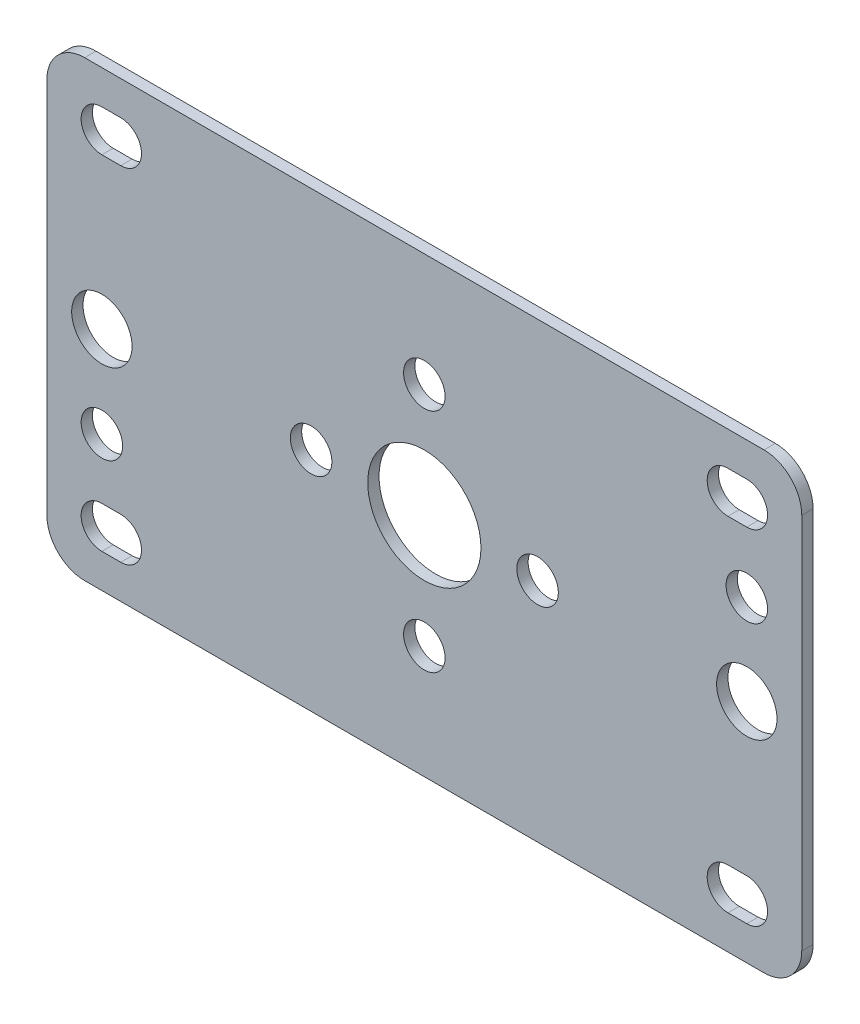
ISO-10303-21;
HEADER;
FILE_DESCRIPTION(('STEP AP214'),'2;1');
FILE_NAME('part.step','',(''),(''),'','','');
FILE_SCHEMA(('AUTOMOTIVE_DESIGN { 1 0 10303 214 1 1 1 1 }'));
ENDSEC;
DATA;
#1=APPLICATION_CONTEXT('core data for automotive mechanical design processes');
#2=APPLICATION_PROTOCOL_DEFINITION('international standard','automotive_design',2000,#1);
#3=PRODUCT_CONTEXT('',#1,'mechanical');
#4=PRODUCT('Part','Part','',(#3));
#5=PRODUCT_RELATED_PRODUCT_CATEGORY('part','',(#4));
#6=PRODUCT_DEFINITION_FORMATION('','',#4);
#7=PRODUCT_DEFINITION_CONTEXT('part definition',#1,'design');
#8=PRODUCT_DEFINITION('design','',#6,#7);
#9=PRODUCT_DEFINITION_SHAPE('','',#8);
#10=(LENGTH_UNIT() NAMED_UNIT(*) SI_UNIT(.MILLI.,.METRE.));
#11=(NAMED_UNIT(*) PLANE_ANGLE_UNIT() SI_UNIT($,.RADIAN.));
#12=(NAMED_UNIT(*) SI_UNIT($,.STERADIAN.) SOLID_ANGLE_UNIT());
#13=UNCERTAINTY_MEASURE_WITH_UNIT(LENGTH_MEASURE(1.E-05),#10,'distance_accuracy_value','');
#14=(GEOMETRIC_REPRESENTATION_CONTEXT(3) GLOBAL_UNCERTAINTY_ASSIGNED_CONTEXT((#13)) GLOBAL_UNIT_ASSIGNED_CONTEXT((#10,
#11,#12)) REPRESENTATION_CONTEXT('',''));
#15=CARTESIAN_POINT('',(0.,0.,0.));
#16=DIRECTION('',(0.,0.,1.));
#17=DIRECTION('',(1.,0.,0.));
#18=AXIS2_PLACEMENT_3D('',#15,#16,#17);
#19=CARTESIAN_POINT('',(0.,0.,0.));
#20=DIRECTION('',(0.,0.,1.));
#21=DIRECTION('',(1.,0.,0.));
#22=AXIS2_PLACEMENT_3D('',#19,#20,#21);
#23=PLANE('',#22);
#24=CARTESIAN_POINT('',(42.72,-22.75,0.));
#25=DIRECTION('',(0.,0.,1.));
#26=DIRECTION('',(1.,0.,0.));
#27=AXIS2_PLACEMENT_3D('',#24,#25,#26);
#28=CIRCLE('',#27,2.75);
#29=CARTESIAN_POINT('',(42.72,-20.,0.));
#30=VERTEX_POINT('',#29);
#31=CARTESIAN_POINT('',(42.72,-25.5,0.));
#32=VERTEX_POINT('',#31);
#33=EDGE_CURVE('E200',#30,#32,#28,.F.);
#34=ORIENTED_EDGE('',*,*,#33,.T.);
#35=DIRECTION('',(1.,0.,0.));
#36=VECTOR('',#35,1.);
#37=CARTESIAN_POINT('',(42.72,-25.5,0.));
#38=LINE('',#37,#36);
#39=CARTESIAN_POINT('',(40.22,-25.5,0.));
#40=VERTEX_POINT('',#39);
#41=EDGE_CURVE('E202',#40,#32,#38,.T.);
#42=ORIENTED_EDGE('',*,*,#41,.F.);
#43=CARTESIAN_POINT('',(40.22,-22.75,0.));
#44=DIRECTION('',(0.,0.,1.));
#45=DIRECTION('',(1.,0.,0.));
#46=AXIS2_PLACEMENT_3D('',#43,#44,#45);
#47=CIRCLE('',#46,2.75);
#48=CARTESIAN_POINT('',(40.22,-20.,0.));
#49=VERTEX_POINT('',#48);
#50=EDGE_CURVE('E204',#40,#49,#47,.F.);
#51=ORIENTED_EDGE('',*,*,#50,.T.);
#52=DIRECTION('',(1.,0.,0.));
#53=VECTOR('',#52,1.);
#54=CARTESIAN_POINT('',(40.22,-20.,0.));
#55=LINE('',#54,#53);
#56=EDGE_CURVE('E197',#30,#49,#55,.F.);
#57=ORIENTED_EDGE('',*,*,#56,.F.);
#58=EDGE_LOOP('',(#34,#42,#51,#57));
#59=FACE_BOUND('',#58,.T.);
#60=DIRECTION('',(1.,0.,0.));
#61=VECTOR('',#60,1.);
#62=CARTESIAN_POINT('',(-40.22,-25.5,0.));
#63=LINE('',#62,#61);
#64=CARTESIAN_POINT('',(-42.72,-25.5,0.));
#65=VERTEX_POINT('',#64);
#66=CARTESIAN_POINT('',(-40.22,-25.5,0.));
#67=VERTEX_POINT('',#66);
#68=EDGE_CURVE('E205',#65,#67,#63,.T.);
#69=ORIENTED_EDGE('',*,*,#68,.F.);
#70=CARTESIAN_POINT('',(-42.72,-22.75,0.));
#71=DIRECTION('',(0.,0.,1.));
#72=DIRECTION('',(1.,0.,0.));
#73=AXIS2_PLACEMENT_3D('',#70,#71,#72);
#74=CIRCLE('',#73,2.75);
#75=CARTESIAN_POINT('',(-42.72,-20.,0.));
#76=VERTEX_POINT('',#75);
#77=EDGE_CURVE('E320',#65,#76,#74,.F.);
#78=ORIENTED_EDGE('',*,*,#77,.T.);
#79=DIRECTION('',(1.,0.,0.));
#80=VECTOR('',#79,1.);
#81=CARTESIAN_POINT('',(-42.72,-20.,0.));
#82=LINE('',#81,#80);
#83=CARTESIAN_POINT('',(-40.22,-20.,0.));
#84=VERTEX_POINT('',#83);
#85=EDGE_CURVE('E209',#84,#76,#82,.F.);
#86=ORIENTED_EDGE('',*,*,#85,.F.);
#87=CARTESIAN_POINT('',(-40.22,-22.75,0.));
#88=DIRECTION('',(0.,0.,1.));
#89=DIRECTION('',(1.,0.,0.));
#90=AXIS2_PLACEMENT_3D('',#87,#88,#89);
#91=CIRCLE('',#90,2.75);
#92=EDGE_CURVE('E212',#84,#67,#91,.F.);
#93=ORIENTED_EDGE('',*,*,#92,.T.);
#94=EDGE_LOOP('',(#69,#78,#86,#93));
#95=FACE_BOUND('',#94,.T.);
#96=CARTESIAN_POINT('',(-42.72,22.75,0.));
#97=DIRECTION('',(0.,0.,1.));
#98=DIRECTION('',(1.,0.,0.));
#99=AXIS2_PLACEMENT_3D('',#96,#97,#98);
#100=CIRCLE('',#99,2.75);
#101=CARTESIAN_POINT('',(-42.72,20.,0.));
#102=VERTEX_POINT('',#101);
#103=CARTESIAN_POINT('',(-42.72,25.5,0.));
#104=VERTEX_POINT('',#103);
#105=EDGE_CURVE('E217',#102,#104,#100,.F.);
#106=ORIENTED_EDGE('',*,*,#105,.T.);
#107=DIRECTION('',(1.,0.,0.));
#108=VECTOR('',#107,1.);
#109=CARTESIAN_POINT('',(-42.72,25.5,0.));
#110=LINE('',#109,#108);
#111=CARTESIAN_POINT('',(-40.22,25.5,0.));
#112=VERTEX_POINT('',#111);
#113=EDGE_CURVE('E219',#112,#104,#110,.F.);
#114=ORIENTED_EDGE('',*,*,#113,.F.);
#115=CARTESIAN_POINT('',(-40.22,22.75,0.));
#116=DIRECTION('',(0.,0.,1.));
#117=DIRECTION('',(1.,0.,0.));
#118=AXIS2_PLACEMENT_3D('',#115,#116,#117);
#119=CIRCLE('',#118,2.75);
#120=CARTESIAN_POINT('',(-40.22,20.,0.));
#121=VERTEX_POINT('',#120);
#122=EDGE_CURVE('E221',#112,#121,#119,.F.);
#123=ORIENTED_EDGE('',*,*,#122,.T.);
#124=DIRECTION('',(1.,0.,0.));
#125=VECTOR('',#124,1.);
#126=CARTESIAN_POINT('',(-40.22,20.,0.));
#127=LINE('',#126,#125);
#128=EDGE_CURVE('E214',#102,#121,#127,.T.);
#129=ORIENTED_EDGE('',*,*,#128,.F.);
#130=EDGE_LOOP('',(#106,#114,#123,#129));
#131=FACE_BOUND('',#130,.T.);
#132=DIRECTION('',(1.,0.,0.));
#133=VECTOR('',#132,1.);
#134=CARTESIAN_POINT('',(40.22,25.5,0.));
#135=LINE('',#134,#133);
#136=CARTESIAN_POINT('',(42.72,25.5,0.));
#137=VERTEX_POINT('',#136);
#138=CARTESIAN_POINT('',(40.22,25.5,0.));
#139=VERTEX_POINT('',#138);
#140=EDGE_CURVE('E222',#137,#139,#135,.F.);
#141=ORIENTED_EDGE('',*,*,#140,.F.);
#142=CARTESIAN_POINT('',(42.72,22.75,0.));
#143=DIRECTION('',(0.,0.,1.));
#144=DIRECTION('',(1.,0.,0.));
#145=AXIS2_PLACEMENT_3D('',#142,#143,#144);
#146=CIRCLE('',#145,2.75);
#147=CARTESIAN_POINT('',(42.72,20.,0.));
#148=VERTEX_POINT('',#147);
#149=EDGE_CURVE('E330',#137,#148,#146,.F.);
#150=ORIENTED_EDGE('',*,*,#149,.T.);
#151=DIRECTION('',(1.,0.,0.));
#152=VECTOR('',#151,1.);
#153=CARTESIAN_POINT('',(42.72,20.,0.));
#154=LINE('',#153,#152);
#155=CARTESIAN_POINT('',(40.22,20.,0.));
#156=VERTEX_POINT('',#155);
#157=EDGE_CURVE('E226',#156,#148,#154,.T.);
#158=ORIENTED_EDGE('',*,*,#157,.F.);
#159=CARTESIAN_POINT('',(40.22,22.75,0.));
#160=DIRECTION('',(0.,0.,1.));
#161=DIRECTION('',(1.,0.,0.));
#162=AXIS2_PLACEMENT_3D('',#159,#160,#161);
#163=CIRCLE('',#162,2.75);
#164=EDGE_CURVE('E228',#156,#139,#163,.F.);
#165=ORIENTED_EDGE('',*,*,#164,.T.);
#166=EDGE_LOOP('',(#141,#150,#158,#165));
#167=FACE_BOUND('',#166,.T.);
#168=CARTESIAN_POINT('',(42.72,0.,0.));
#169=DIRECTION('',(0.,0.,1.));
#170=DIRECTION('',(1.,0.,0.));
#171=AXIS2_PLACEMENT_3D('',#168,#169,#170);
#172=CIRCLE('',#171,4.);
#173=CARTESIAN_POINT('',(46.72,0.,0.));
#174=VERTEX_POINT('',#173);
#175=EDGE_CURVE('E332',#174,#174,#172,.F.);
#176=ORIENTED_EDGE('',*,*,#175,.T.);
#177=EDGE_LOOP('',(#176));
#178=FACE_BOUND('',#177,.T.);
#179=CARTESIAN_POINT('',(0.,0.,0.));
#180=DIRECTION('',(0.,0.,1.));
#181=DIRECTION('',(1.,0.,0.));
#182=AXIS2_PLACEMENT_3D('',#179,#180,#181);
#183=CIRCLE('',#182,7.5);
#184=CARTESIAN_POINT('',(7.5,0.,0.));
#185=VERTEX_POINT('',#184);
#186=EDGE_CURVE('E335',#185,#185,#183,.F.);
#187=ORIENTED_EDGE('',*,*,#186,.T.);
#188=EDGE_LOOP('',(#187));
#189=FACE_BOUND('',#188,.T.);
#190=CARTESIAN_POINT('',(0.,-15.,0.));
#191=DIRECTION('',(0.,0.,1.));
#192=DIRECTION('',(1.,0.,0.));
#193=AXIS2_PLACEMENT_3D('',#190,#191,#192);
#194=CIRCLE('',#193,2.75);
#195=CARTESIAN_POINT('',(2.75,-15.,0.));
#196=VERTEX_POINT('',#195);
#197=EDGE_CURVE('E338',#196,#196,#194,.F.);
#198=ORIENTED_EDGE('',*,*,#197,.T.);
#199=EDGE_LOOP('',(#198));
#200=FACE_BOUND('',#199,.T.);
#201=CARTESIAN_POINT('',(-15.,0.,0.));
#202=DIRECTION('',(0.,0.,1.));
#203=DIRECTION('',(1.,0.,0.));
#204=AXIS2_PLACEMENT_3D('',#201,#202,#203);
#205=CIRCLE('',#204,2.75);
#206=CARTESIAN_POINT('',(-12.25,0.,0.));
#207=VERTEX_POINT('',#206);
#208=EDGE_CURVE('E341',#207,#207,#205,.F.);
#209=ORIENTED_EDGE('',*,*,#208,.T.);
#210=EDGE_LOOP('',(#209));
#211=FACE_BOUND('',#210,.T.);
#212=CARTESIAN_POINT('',(0.,15.,0.));
#213=DIRECTION('',(0.,0.,1.));
#214=DIRECTION('',(1.,0.,0.));
#215=AXIS2_PLACEMENT_3D('',#212,#213,#214);
#216=CIRCLE('',#215,2.75);
#217=CARTESIAN_POINT('',(2.75000000000001,15.,0.));
#218=VERTEX_POINT('',#217);
#219=EDGE_CURVE('E344',#218,#218,#216,.F.);
#220=ORIENTED_EDGE('',*,*,#219,.T.);
#221=EDGE_LOOP('',(#220));
#222=FACE_BOUND('',#221,.T.);
#223=CARTESIAN_POINT('',(15.,0.,0.));
#224=DIRECTION('',(0.,0.,1.));
#225=DIRECTION('',(1.,0.,0.));
#226=AXIS2_PLACEMENT_3D('',#223,#224,#225);
#227=CIRCLE('',#226,2.75);
#228=CARTESIAN_POINT('',(17.75,0.,0.));
#229=VERTEX_POINT('',#228);
#230=EDGE_CURVE('E347',#229,#229,#227,.F.);
#231=ORIENTED_EDGE('',*,*,#230,.T.);
#232=EDGE_LOOP('',(#231));
#233=FACE_BOUND('',#232,.T.);
#234=CARTESIAN_POINT('',(-42.72,-12.05,0.));
#235=DIRECTION('',(0.,0.,1.));
#236=DIRECTION('',(1.,0.,0.));
#237=AXIS2_PLACEMENT_3D('',#234,#235,#236);
#238=CIRCLE('',#237,2.75);
#239=CARTESIAN_POINT('',(-39.97,-12.05,0.));
#240=VERTEX_POINT('',#239);
#241=EDGE_CURVE('E350',#240,#240,#238,.F.);
#242=ORIENTED_EDGE('',*,*,#241,.T.);
#243=EDGE_LOOP('',(#242));
#244=FACE_BOUND('',#243,.T.);
#245=CARTESIAN_POINT('',(42.72,11.97,0.));
#246=DIRECTION('',(0.,0.,1.));
#247=DIRECTION('',(1.,0.,0.));
#248=AXIS2_PLACEMENT_3D('',#245,#246,#247);
#249=CIRCLE('',#248,2.75);
#250=CARTESIAN_POINT('',(45.47,11.97,0.));
#251=VERTEX_POINT('',#250);
#252=EDGE_CURVE('E353',#251,#251,#249,.F.);
#253=ORIENTED_EDGE('',*,*,#252,.T.);
#254=EDGE_LOOP('',(#253));
#255=FACE_BOUND('',#254,.T.);
#256=CARTESIAN_POINT('',(-42.72,0.,0.));
#257=DIRECTION('',(0.,0.,1.));
#258=DIRECTION('',(1.,0.,0.));
#259=AXIS2_PLACEMENT_3D('',#256,#257,#258);
#260=CIRCLE('',#259,4.);
#261=CARTESIAN_POINT('',(-38.72,0.,0.));
#262=VERTEX_POINT('',#261);
#263=EDGE_CURVE('E356',#262,#262,#260,.F.);
#264=ORIENTED_EDGE('',*,*,#263,.T.);
#265=EDGE_LOOP('',(#264));
#266=FACE_BOUND('',#265,.T.);
#267=CARTESIAN_POINT('',(45.,25.,0.));
#268=DIRECTION('',(0.,0.,1.));
#269=DIRECTION('',(1.,0.,0.));
#270=AXIS2_PLACEMENT_3D('',#267,#268,#269);
#271=CIRCLE('',#270,5.);
#272=CARTESIAN_POINT('',(45.,30.,0.));
#273=VERTEX_POINT('',#272);
#274=CARTESIAN_POINT('',(50.,25.,0.));
#275=VERTEX_POINT('',#274);
#276=EDGE_CURVE('E177',#273,#275,#271,.F.);
#277=ORIENTED_EDGE('',*,*,#276,.F.);
#278=DIRECTION('',(1.,0.,0.));
#279=VECTOR('',#278,1.);
#280=CARTESIAN_POINT('',(45.,30.,0.));
#281=LINE('',#280,#279);
#282=CARTESIAN_POINT('',(-45.,30.,0.));
#283=VERTEX_POINT('',#282);
#284=EDGE_CURVE('E175',#283,#273,#281,.T.);
#285=ORIENTED_EDGE('',*,*,#284,.F.);
#286=CARTESIAN_POINT('',(-45.,25.,0.));
#287=DIRECTION('',(0.,0.,1.));
#288=DIRECTION('',(1.,0.,0.));
#289=AXIS2_PLACEMENT_3D('',#286,#287,#288);
#290=CIRCLE('',#289,5.);
#291=CARTESIAN_POINT('',(-50.,25.,0.));
#292=VERTEX_POINT('',#291);
#293=EDGE_CURVE('E19',#292,#283,#290,.F.);
#294=ORIENTED_EDGE('',*,*,#293,.F.);
#295=DIRECTION('',(0.,1.,0.));
#296=VECTOR('',#295,1.);
#297=CARTESIAN_POINT('',(-50.,25.,0.));
#298=LINE('',#297,#296);
#299=CARTESIAN_POINT('',(-50.,-25.,0.));
#300=VERTEX_POINT('',#299);
#301=EDGE_CURVE('E241',#300,#292,#298,.T.);
#302=ORIENTED_EDGE('',*,*,#301,.F.);
#303=CARTESIAN_POINT('',(-45.,-25.,0.));
#304=DIRECTION('',(0.,0.,1.));
#305=DIRECTION('',(1.,0.,0.));
#306=AXIS2_PLACEMENT_3D('',#303,#304,#305);
#307=CIRCLE('',#306,5.);
#308=CARTESIAN_POINT('',(-45.,-30.,0.));
#309=VERTEX_POINT('',#308);
#310=EDGE_CURVE('E363',#309,#300,#307,.F.);
#311=ORIENTED_EDGE('',*,*,#310,.F.);
#312=DIRECTION('',(1.,0.,0.));
#313=VECTOR('',#312,1.);
#314=CARTESIAN_POINT('',(-45.,-30.,0.));
#315=LINE('',#314,#313);
#316=CARTESIAN_POINT('',(45.,-30.,0.));
#317=VERTEX_POINT('',#316);
#318=EDGE_CURVE('E236',#317,#309,#315,.F.);
#319=ORIENTED_EDGE('',*,*,#318,.F.);
#320=CARTESIAN_POINT('',(45.,-25.,0.));
#321=DIRECTION('',(0.,0.,1.));
#322=DIRECTION('',(1.,0.,0.));
#323=AXIS2_PLACEMENT_3D('',#320,#321,#322);
#324=CIRCLE('',#323,5.);
#325=CARTESIAN_POINT('',(50.,-25.,0.));
#326=VERTEX_POINT('',#325);
#327=EDGE_CURVE('E361',#326,#317,#324,.F.);
#328=ORIENTED_EDGE('',*,*,#327,.F.);
#329=DIRECTION('',(0.,1.,0.));
#330=VECTOR('',#329,1.);
#331=CARTESIAN_POINT('',(50.,-25.,0.));
#332=LINE('',#331,#330);
#333=EDGE_CURVE('E231',#275,#326,#332,.F.);
#334=ORIENTED_EDGE('',*,*,#333,.F.);
#335=EDGE_LOOP('',(#277,#285,#294,#302,#311,#319,#328,#334));
#336=FACE_BOUND('',#335,.T.);
#337=ADVANCED_FACE('F16',(#59,#95,#131,#167,#178,#189,#200,#211,#222,#233,#244,#255,#266,#336),
#23,.T.);
#338=CARTESIAN_POINT('',(45.,30.,0.));
#339=DIRECTION('',(0.,1.,0.));
#340=DIRECTION('',(0.,0.,1.));
#341=AXIS2_PLACEMENT_3D('',#338,#339,#340);
#342=PLANE('',#341);
#343=DIRECTION('',(0.,0.,1.));
#344=VECTOR('',#343,1.);
#345=CARTESIAN_POINT('',(-45.,30.,0.));
#346=LINE('',#345,#344);
#347=CARTESIAN_POINT('',(-45.,30.,-1.5));
#348=VERTEX_POINT('',#347);
#349=EDGE_CURVE('E182',#283,#348,#346,.F.);
#350=ORIENTED_EDGE('',*,*,#349,.F.);
#351=ORIENTED_EDGE('',*,*,#284,.T.);
#352=DIRECTION('',(0.,0.,1.));
#353=VECTOR('',#352,1.);
#354=CARTESIAN_POINT('',(45.,30.,0.));
#355=LINE('',#354,#353);
#356=CARTESIAN_POINT('',(45.,30.,-1.5));
#357=VERTEX_POINT('',#356);
#358=EDGE_CURVE('E360',#357,#273,#355,.T.);
#359=ORIENTED_EDGE('',*,*,#358,.F.);
#360=DIRECTION('',(1.,0.,0.));
#361=VECTOR('',#360,1.);
#362=CARTESIAN_POINT('',(0.,30.,-1.5));
#363=LINE('',#362,#361);
#364=EDGE_CURVE('E192',#357,#348,#363,.F.);
#365=ORIENTED_EDGE('',*,*,#364,.T.);
#366=EDGE_LOOP('',(#350,#351,#359,#365));
#367=FACE_BOUND('',#366,.T.);
#368=ADVANCED_FACE('F191',(#367),#342,.T.);
#369=CARTESIAN_POINT('',(-45.,25.,0.));
#370=DIRECTION('',(0.,0.,1.));
#371=DIRECTION('',(1.,0.,0.));
#372=AXIS2_PLACEMENT_3D('',#369,#370,#371);
#373=CYLINDRICAL_SURFACE('',#372,5.);
#374=DIRECTION('',(0.,0.,1.));
#375=VECTOR('',#374,1.);
#376=CARTESIAN_POINT('',(-50.,25.,0.));
#377=LINE('',#376,#375);
#378=CARTESIAN_POINT('',(-50.,25.,-1.5));
#379=VERTEX_POINT('',#378);
#380=EDGE_CURVE('E189',#292,#379,#377,.F.);
#381=ORIENTED_EDGE('',*,*,#380,.F.);
#382=ORIENTED_EDGE('',*,*,#293,.T.);
#383=ORIENTED_EDGE('',*,*,#349,.T.);
#384=CARTESIAN_POINT('',(-45.,25.,-1.5));
#385=DIRECTION('',(0.,0.,1.));
#386=DIRECTION('',(1.,0.,0.));
#387=AXIS2_PLACEMENT_3D('',#384,#385,#386);
#388=CIRCLE('',#387,5.);
#389=EDGE_CURVE('E311',#348,#379,#388,.T.);
#390=ORIENTED_EDGE('',*,*,#389,.T.);
#391=EDGE_LOOP('',(#381,#382,#383,#390));
#392=FACE_BOUND('',#391,.T.);
#393=ADVANCED_FACE('F186',(#392),#373,.T.);
#394=CARTESIAN_POINT('',(-50.,25.,0.));
#395=DIRECTION('',(-1.,0.,0.));
#396=DIRECTION('',(0.,0.,1.));
#397=AXIS2_PLACEMENT_3D('',#394,#395,#396);
#398=PLANE('',#397);
#399=DIRECTION('',(0.,0.,1.));
#400=VECTOR('',#399,1.);
#401=CARTESIAN_POINT('',(-50.,-25.,0.));
#402=LINE('',#401,#400);
#403=CARTESIAN_POINT('',(-50.,-25.,-1.5));
#404=VERTEX_POINT('',#403);
#405=EDGE_CURVE('E242',#300,#404,#402,.F.);
#406=ORIENTED_EDGE('',*,*,#405,.F.);
#407=ORIENTED_EDGE('',*,*,#301,.T.);
#408=ORIENTED_EDGE('',*,*,#380,.T.);
#409=DIRECTION('',(0.,1.,0.));
#410=VECTOR('',#409,1.);
#411=CARTESIAN_POINT('',(-50.,0.,-1.5));
#412=LINE('',#411,#410);
#413=EDGE_CURVE('E310',#379,#404,#412,.F.);
#414=ORIENTED_EDGE('',*,*,#413,.T.);
#415=EDGE_LOOP('',(#406,#407,#408,#414));
#416=FACE_BOUND('',#415,.T.);
#417=ADVANCED_FACE('F556',(#416),#398,.T.);
#418=CARTESIAN_POINT('',(-45.,-25.,0.));
#419=DIRECTION('',(0.,0.,1.));
#420=DIRECTION('',(1.,0.,0.));
#421=AXIS2_PLACEMENT_3D('',#418,#419,#420);
#422=CYLINDRICAL_SURFACE('',#421,5.);
#423=DIRECTION('',(0.,0.,-1.));
#424=VECTOR('',#423,1.);
#425=CARTESIAN_POINT('',(-45.,-30.,0.));
#426=LINE('',#425,#424);
#427=CARTESIAN_POINT('',(-45.,-30.,-1.5));
#428=VERTEX_POINT('',#427);
#429=EDGE_CURVE('E240',#309,#428,#426,.T.);
#430=ORIENTED_EDGE('',*,*,#429,.F.);
#431=ORIENTED_EDGE('',*,*,#310,.T.);
#432=ORIENTED_EDGE('',*,*,#405,.T.);
#433=CARTESIAN_POINT('',(-45.,-25.,-1.5));
#434=DIRECTION('',(0.,0.,1.));
#435=DIRECTION('',(1.,0.,0.));
#436=AXIS2_PLACEMENT_3D('',#433,#434,#435);
#437=CIRCLE('',#436,5.);
#438=EDGE_CURVE('E307',#404,#428,#437,.T.);
#439=ORIENTED_EDGE('',*,*,#438,.T.);
#440=EDGE_LOOP('',(#430,#431,#432,#439));
#441=FACE_BOUND('',#440,.T.);
#442=ADVANCED_FACE('F552',(#441),#422,.T.);
#443=CARTESIAN_POINT('',(-45.,-30.,0.));
#444=DIRECTION('',(0.,-1.,0.));
#445=DIRECTION('',(0.,0.,-1.));
#446=AXIS2_PLACEMENT_3D('',#443,#444,#445);
#447=PLANE('',#446);
#448=DIRECTION('',(0.,0.,1.));
#449=VECTOR('',#448,1.);
#450=CARTESIAN_POINT('',(45.,-30.,0.));
#451=LINE('',#450,#449);
#452=CARTESIAN_POINT('',(45.,-30.,-1.5));
#453=VERTEX_POINT('',#452);
#454=EDGE_CURVE('E239',#317,#453,#451,.F.);
#455=ORIENTED_EDGE('',*,*,#454,.F.);
#456=ORIENTED_EDGE('',*,*,#318,.T.);
#457=ORIENTED_EDGE('',*,*,#429,.T.);
#458=DIRECTION('',(1.,0.,0.));
#459=VECTOR('',#458,1.);
#460=CARTESIAN_POINT('',(0.,-30.,-1.5));
#461=LINE('',#460,#459);
#462=EDGE_CURVE('E306',#428,#453,#461,.T.);
#463=ORIENTED_EDGE('',*,*,#462,.T.);
#464=EDGE_LOOP('',(#455,#456,#457,#463));
#465=FACE_BOUND('',#464,.T.);
#466=ADVANCED_FACE('F548',(#465),#447,.T.);
#467=CARTESIAN_POINT('',(45.,-25.,0.));
#468=DIRECTION('',(0.,0.,1.));
#469=DIRECTION('',(1.,0.,0.));
#470=AXIS2_PLACEMENT_3D('',#467,#468,#469);
#471=CYLINDRICAL_SURFACE('',#470,5.);
#472=DIRECTION('',(0.,0.,-1.));
#473=VECTOR('',#472,1.);
#474=CARTESIAN_POINT('',(50.,-25.,0.));
#475=LINE('',#474,#473);
#476=CARTESIAN_POINT('',(50.,-25.,-1.5));
#477=VERTEX_POINT('',#476);
#478=EDGE_CURVE('E235',#326,#477,#475,.T.);
#479=ORIENTED_EDGE('',*,*,#478,.F.);
#480=ORIENTED_EDGE('',*,*,#327,.T.);
#481=ORIENTED_EDGE('',*,*,#454,.T.);
#482=CARTESIAN_POINT('',(45.,-25.,-1.5));
#483=DIRECTION('',(0.,0.,1.));
#484=DIRECTION('',(1.,0.,0.));
#485=AXIS2_PLACEMENT_3D('',#482,#483,#484);
#486=CIRCLE('',#485,5.);
#487=EDGE_CURVE('E303',#453,#477,#486,.T.);
#488=ORIENTED_EDGE('',*,*,#487,.T.);
#489=EDGE_LOOP('',(#479,#480,#481,#488));
#490=FACE_BOUND('',#489,.T.);
#491=ADVANCED_FACE('F544',(#490),#471,.T.);
#492=CARTESIAN_POINT('',(50.,-25.,0.));
#493=DIRECTION('',(1.,0.,0.));
#494=DIRECTION('',(0.,0.,-1.));
#495=AXIS2_PLACEMENT_3D('',#492,#493,#494);
#496=PLANE('',#495);
#497=DIRECTION('',(0.,0.,1.));
#498=VECTOR('',#497,1.);
#499=CARTESIAN_POINT('',(50.,25.,0.));
#500=LINE('',#499,#498);
#501=CARTESIAN_POINT('',(50.,25.,-1.5));
#502=VERTEX_POINT('',#501);
#503=EDGE_CURVE('E234',#275,#502,#500,.F.);
#504=ORIENTED_EDGE('',*,*,#503,.F.);
#505=ORIENTED_EDGE('',*,*,#333,.T.);
#506=ORIENTED_EDGE('',*,*,#478,.T.);
#507=DIRECTION('',(0.,1.,0.));
#508=VECTOR('',#507,1.);
#509=CARTESIAN_POINT('',(50.,0.,-1.5));
#510=LINE('',#509,#508);
#511=EDGE_CURVE('E302',#477,#502,#510,.T.);
#512=ORIENTED_EDGE('',*,*,#511,.T.);
#513=EDGE_LOOP('',(#504,#505,#506,#512));
#514=FACE_BOUND('',#513,.T.);
#515=ADVANCED_FACE('F540',(#514),#496,.T.);
#516=CARTESIAN_POINT('',(45.,25.,0.));
#517=DIRECTION('',(0.,0.,1.));
#518=DIRECTION('',(1.,0.,0.));
#519=AXIS2_PLACEMENT_3D('',#516,#517,#518);
#520=CYLINDRICAL_SURFACE('',#519,5.);
#521=ORIENTED_EDGE('',*,*,#358,.T.);
#522=ORIENTED_EDGE('',*,*,#276,.T.);
#523=ORIENTED_EDGE('',*,*,#503,.T.);
#524=CARTESIAN_POINT('',(45.,25.,-1.5));
#525=DIRECTION('',(0.,0.,1.));
#526=DIRECTION('',(1.,0.,0.));
#527=AXIS2_PLACEMENT_3D('',#524,#525,#526);
#528=CIRCLE('',#527,5.);
#529=EDGE_CURVE('E299',#502,#357,#528,.T.);
#530=ORIENTED_EDGE('',*,*,#529,.T.);
#531=EDGE_LOOP('',(#521,#522,#523,#530));
#532=FACE_BOUND('',#531,.T.);
#533=ADVANCED_FACE('F536',(#532),#520,.T.);
#534=CARTESIAN_POINT('',(-42.72,0.,0.));
#535=DIRECTION('',(0.,0.,1.));
#536=DIRECTION('',(1.,0.,0.));
#537=AXIS2_PLACEMENT_3D('',#534,#535,#536);
#538=CYLINDRICAL_SURFACE('',#537,4.);
#539=CARTESIAN_POINT('',(-42.72,0.,-1.5));
#540=DIRECTION('',(0.,0.,1.));
#541=DIRECTION('',(1.,0.,0.));
#542=AXIS2_PLACEMENT_3D('',#539,#540,#541);
#543=CIRCLE('',#542,4.);
#544=CARTESIAN_POINT('',(-38.72,0.,-1.5));
#545=VERTEX_POINT('',#544);
#546=EDGE_CURVE('E296',#545,#545,#543,.F.);
#547=ORIENTED_EDGE('',*,*,#546,.T.);
#548=EDGE_LOOP('',(#547));
#549=FACE_BOUND('',#548,.T.);
#550=ORIENTED_EDGE('',*,*,#263,.F.);
#551=EDGE_LOOP('',(#550));
#552=FACE_BOUND('',#551,.T.);
#553=ADVANCED_FACE('F532',(#549,#552),#538,.F.);
#554=CARTESIAN_POINT('',(42.72,11.97,0.));
#555=DIRECTION('',(0.,0.,1.));
#556=DIRECTION('',(1.,0.,0.));
#557=AXIS2_PLACEMENT_3D('',#554,#555,#556);
#558=CYLINDRICAL_SURFACE('',#557,2.75);
#559=CARTESIAN_POINT('',(42.72,11.97,-1.5));
#560=DIRECTION('',(0.,0.,1.));
#561=DIRECTION('',(1.,0.,0.));
#562=AXIS2_PLACEMENT_3D('',#559,#560,#561);
#563=CIRCLE('',#562,2.75);
#564=CARTESIAN_POINT('',(45.47,11.97,-1.5));
#565=VERTEX_POINT('',#564);
#566=EDGE_CURVE('E293',#565,#565,#563,.F.);
#567=ORIENTED_EDGE('',*,*,#566,.T.);
#568=EDGE_LOOP('',(#567));
#569=FACE_BOUND('',#568,.T.);
#570=ORIENTED_EDGE('',*,*,#252,.F.);
#571=EDGE_LOOP('',(#570));
#572=FACE_BOUND('',#571,.T.);
#573=ADVANCED_FACE('F528',(#569,#572),#558,.F.);
#574=CARTESIAN_POINT('',(-42.72,-12.05,0.));
#575=DIRECTION('',(0.,0.,1.));
#576=DIRECTION('',(1.,0.,0.));
#577=AXIS2_PLACEMENT_3D('',#574,#575,#576);
#578=CYLINDRICAL_SURFACE('',#577,2.75);
#579=CARTESIAN_POINT('',(-42.72,-12.05,-1.5));
#580=DIRECTION('',(0.,0.,1.));
#581=DIRECTION('',(1.,0.,0.));
#582=AXIS2_PLACEMENT_3D('',#579,#580,#581);
#583=CIRCLE('',#582,2.75);
#584=CARTESIAN_POINT('',(-39.97,-12.05,-1.5));
#585=VERTEX_POINT('',#584);
#586=EDGE_CURVE('E290',#585,#585,#583,.F.);
#587=ORIENTED_EDGE('',*,*,#586,.T.);
#588=EDGE_LOOP('',(#587));
#589=FACE_BOUND('',#588,.T.);
#590=ORIENTED_EDGE('',*,*,#241,.F.);
#591=EDGE_LOOP('',(#590));
#592=FACE_BOUND('',#591,.T.);
#593=ADVANCED_FACE('F524',(#589,#592),#578,.F.);
#594=CARTESIAN_POINT('',(15.,0.,0.));
#595=DIRECTION('',(0.,0.,1.));
#596=DIRECTION('',(1.,0.,0.));
#597=AXIS2_PLACEMENT_3D('',#594,#595,#596);
#598=CYLINDRICAL_SURFACE('',#597,2.75);
#599=CARTESIAN_POINT('',(15.,0.,-1.5));
#600=DIRECTION('',(0.,0.,1.));
#601=DIRECTION('',(1.,0.,0.));
#602=AXIS2_PLACEMENT_3D('',#599,#600,#601);
#603=CIRCLE('',#602,2.75);
#604=CARTESIAN_POINT('',(17.75,0.,-1.5));
#605=VERTEX_POINT('',#604);
#606=EDGE_CURVE('E287',#605,#605,#603,.F.);
#607=ORIENTED_EDGE('',*,*,#606,.T.);
#608=EDGE_LOOP('',(#607));
#609=FACE_BOUND('',#608,.T.);
#610=ORIENTED_EDGE('',*,*,#230,.F.);
#611=EDGE_LOOP('',(#610));
#612=FACE_BOUND('',#611,.T.);
#613=ADVANCED_FACE('F520',(#609,#612),#598,.F.);
#614=CARTESIAN_POINT('',(0.,15.,0.));
#615=DIRECTION('',(0.,0.,1.));
#616=DIRECTION('',(1.,0.,0.));
#617=AXIS2_PLACEMENT_3D('',#614,#615,#616);
#618=CYLINDRICAL_SURFACE('',#617,2.75);
#619=CARTESIAN_POINT('',(0.,15.,-1.5));
#620=DIRECTION('',(0.,0.,1.));
#621=DIRECTION('',(1.,0.,0.));
#622=AXIS2_PLACEMENT_3D('',#619,#620,#621);
#623=CIRCLE('',#622,2.75);
#624=CARTESIAN_POINT('',(2.75000000000001,15.,-1.5));
#625=VERTEX_POINT('',#624);
#626=EDGE_CURVE('E284',#625,#625,#623,.F.);
#627=ORIENTED_EDGE('',*,*,#626,.T.);
#628=EDGE_LOOP('',(#627));
#629=FACE_BOUND('',#628,.T.);
#630=ORIENTED_EDGE('',*,*,#219,.F.);
#631=EDGE_LOOP('',(#630));
#632=FACE_BOUND('',#631,.T.);
#633=ADVANCED_FACE('F516',(#629,#632),#618,.F.);
#634=CARTESIAN_POINT('',(-15.,0.,0.));
#635=DIRECTION('',(0.,0.,1.));
#636=DIRECTION('',(1.,0.,0.));
#637=AXIS2_PLACEMENT_3D('',#634,#635,#636);
#638=CYLINDRICAL_SURFACE('',#637,2.75);
#639=CARTESIAN_POINT('',(-15.,0.,-1.5));
#640=DIRECTION('',(0.,0.,1.));
#641=DIRECTION('',(1.,0.,0.));
#642=AXIS2_PLACEMENT_3D('',#639,#640,#641);
#643=CIRCLE('',#642,2.75);
#644=CARTESIAN_POINT('',(-12.25,0.,-1.5));
#645=VERTEX_POINT('',#644);
#646=EDGE_CURVE('E281',#645,#645,#643,.F.);
#647=ORIENTED_EDGE('',*,*,#646,.T.);
#648=EDGE_LOOP('',(#647));
#649=FACE_BOUND('',#648,.T.);
#650=ORIENTED_EDGE('',*,*,#208,.F.);
#651=EDGE_LOOP('',(#650));
#652=FACE_BOUND('',#651,.T.);
#653=ADVANCED_FACE('F512',(#649,#652),#638,.F.);
#654=CARTESIAN_POINT('',(0.,-15.,0.));
#655=DIRECTION('',(0.,0.,1.));
#656=DIRECTION('',(1.,0.,0.));
#657=AXIS2_PLACEMENT_3D('',#654,#655,#656);
#658=CYLINDRICAL_SURFACE('',#657,2.75);
#659=CARTESIAN_POINT('',(0.,-15.,-1.5));
#660=DIRECTION('',(0.,0.,1.));
#661=DIRECTION('',(1.,0.,0.));
#662=AXIS2_PLACEMENT_3D('',#659,#660,#661);
#663=CIRCLE('',#662,2.75);
#664=CARTESIAN_POINT('',(2.75,-15.,-1.5));
#665=VERTEX_POINT('',#664);
#666=EDGE_CURVE('E278',#665,#665,#663,.F.);
#667=ORIENTED_EDGE('',*,*,#666,.T.);
#668=EDGE_LOOP('',(#667));
#669=FACE_BOUND('',#668,.T.);
#670=ORIENTED_EDGE('',*,*,#197,.F.);
#671=EDGE_LOOP('',(#670));
#672=FACE_BOUND('',#671,.T.);
#673=ADVANCED_FACE('F508',(#669,#672),#658,.F.);
#674=CARTESIAN_POINT('',(0.,0.,0.));
#675=DIRECTION('',(0.,0.,1.));
#676=DIRECTION('',(1.,0.,0.));
#677=AXIS2_PLACEMENT_3D('',#674,#675,#676);
#678=CYLINDRICAL_SURFACE('',#677,7.5);
#679=CARTESIAN_POINT('',(0.,0.,-1.5));
#680=DIRECTION('',(0.,0.,1.));
#681=DIRECTION('',(1.,0.,0.));
#682=AXIS2_PLACEMENT_3D('',#679,#680,#681);
#683=CIRCLE('',#682,7.5);
#684=CARTESIAN_POINT('',(7.5,0.,-1.5));
#685=VERTEX_POINT('',#684);
#686=EDGE_CURVE('E275',#685,#685,#683,.F.);
#687=ORIENTED_EDGE('',*,*,#686,.T.);
#688=EDGE_LOOP('',(#687));
#689=FACE_BOUND('',#688,.T.);
#690=ORIENTED_EDGE('',*,*,#186,.F.);
#691=EDGE_LOOP('',(#690));
#692=FACE_BOUND('',#691,.T.);
#693=ADVANCED_FACE('F504',(#689,#692),#678,.F.);
#694=CARTESIAN_POINT('',(42.72,0.,0.));
#695=DIRECTION('',(0.,0.,1.));
#696=DIRECTION('',(1.,0.,0.));
#697=AXIS2_PLACEMENT_3D('',#694,#695,#696);
#698=CYLINDRICAL_SURFACE('',#697,4.);
#699=CARTESIAN_POINT('',(42.72,0.,-1.5));
#700=DIRECTION('',(0.,0.,1.));
#701=DIRECTION('',(1.,0.,0.));
#702=AXIS2_PLACEMENT_3D('',#699,#700,#701);
#703=CIRCLE('',#702,4.);
#704=CARTESIAN_POINT('',(46.72,0.,-1.5));
#705=VERTEX_POINT('',#704);
#706=EDGE_CURVE('E272',#705,#705,#703,.F.);
#707=ORIENTED_EDGE('',*,*,#706,.T.);
#708=EDGE_LOOP('',(#707));
#709=FACE_BOUND('',#708,.T.);
#710=ORIENTED_EDGE('',*,*,#175,.F.);
#711=EDGE_LOOP('',(#710));
#712=FACE_BOUND('',#711,.T.);
#713=ADVANCED_FACE('F500',(#709,#712),#698,.F.);
#714=CARTESIAN_POINT('',(42.72,22.75,0.));
#715=DIRECTION('',(0.,0.,1.));
#716=DIRECTION('',(1.,0.,0.));
#717=AXIS2_PLACEMENT_3D('',#714,#715,#716);
#718=CYLINDRICAL_SURFACE('',#717,2.75);
#719=CARTESIAN_POINT('',(42.72,22.75,-1.5));
#720=DIRECTION('',(0.,0.,1.));
#721=DIRECTION('',(1.,0.,0.));
#722=AXIS2_PLACEMENT_3D('',#719,#720,#721);
#723=CIRCLE('',#722,2.75);
#724=CARTESIAN_POINT('',(42.72,25.5,-1.5));
#725=VERTEX_POINT('',#724);
#726=CARTESIAN_POINT('',(42.72,20.,-1.5));
#727=VERTEX_POINT('',#726);
#728=EDGE_CURVE('E269',#725,#727,#723,.F.);
#729=ORIENTED_EDGE('',*,*,#728,.T.);
#730=DIRECTION('',(0.,0.,1.));
#731=VECTOR('',#730,1.);
#732=CARTESIAN_POINT('',(42.72,20.,0.));
#733=LINE('',#732,#731);
#734=EDGE_CURVE('E229',#148,#727,#733,.F.);
#735=ORIENTED_EDGE('',*,*,#734,.F.);
#736=ORIENTED_EDGE('',*,*,#149,.F.);
#737=DIRECTION('',(0.,0.,-1.));
#738=VECTOR('',#737,1.);
#739=CARTESIAN_POINT('',(42.72,25.5,0.));
#740=LINE('',#739,#738);
#741=EDGE_CURVE('E225',#725,#137,#740,.F.);
#742=ORIENTED_EDGE('',*,*,#741,.F.);
#743=EDGE_LOOP('',(#729,#735,#736,#742));
#744=FACE_BOUND('',#743,.T.);
#745=ADVANCED_FACE('F496',(#744),#718,.F.);
#746=CARTESIAN_POINT('',(42.72,20.,0.));
#747=DIRECTION('',(0.,1.,0.));
#748=DIRECTION('',(0.,0.,1.));
#749=AXIS2_PLACEMENT_3D('',#746,#747,#748);
#750=PLANE('',#749);
#751=DIRECTION('',(0.,0.,1.));
#752=VECTOR('',#751,1.);
#753=CARTESIAN_POINT('',(40.22,20.,0.));
#754=LINE('',#753,#752);
#755=CARTESIAN_POINT('',(40.22,20.,-1.5));
#756=VERTEX_POINT('',#755);
#757=EDGE_CURVE('E329',#756,#156,#754,.T.);
#758=ORIENTED_EDGE('',*,*,#757,.T.);
#759=ORIENTED_EDGE('',*,*,#157,.T.);
#760=ORIENTED_EDGE('',*,*,#734,.T.);
#761=DIRECTION('',(1.,0.,0.));
#762=VECTOR('',#761,1.);
#763=CARTESIAN_POINT('',(0.,20.,-1.5));
#764=LINE('',#763,#762);
#765=EDGE_CURVE('E268',#727,#756,#764,.F.);
#766=ORIENTED_EDGE('',*,*,#765,.T.);
#767=EDGE_LOOP('',(#758,#759,#760,#766));
#768=FACE_BOUND('',#767,.T.);
#769=ADVANCED_FACE('F492',(#768),#750,.T.);
#770=CARTESIAN_POINT('',(40.22,22.75,0.));
#771=DIRECTION('',(0.,0.,1.));
#772=DIRECTION('',(1.,0.,0.));
#773=AXIS2_PLACEMENT_3D('',#770,#771,#772);
#774=CYLINDRICAL_SURFACE('',#773,2.75);
#775=CARTESIAN_POINT('',(40.22,22.75,-1.5));
#776=DIRECTION('',(0.,0.,1.));
#777=DIRECTION('',(1.,0.,0.));
#778=AXIS2_PLACEMENT_3D('',#775,#776,#777);
#779=CIRCLE('',#778,2.75);
#780=CARTESIAN_POINT('',(40.22,25.5,-1.5));
#781=VERTEX_POINT('',#780);
#782=EDGE_CURVE('E264',#756,#781,#779,.F.);
#783=ORIENTED_EDGE('',*,*,#782,.T.);
#784=DIRECTION('',(0.,0.,-1.));
#785=VECTOR('',#784,1.);
#786=CARTESIAN_POINT('',(40.22,25.5,0.));
#787=LINE('',#786,#785);
#788=EDGE_CURVE('E378',#139,#781,#787,.T.);
#789=ORIENTED_EDGE('',*,*,#788,.F.);
#790=ORIENTED_EDGE('',*,*,#164,.F.);
#791=ORIENTED_EDGE('',*,*,#757,.F.);
#792=EDGE_LOOP('',(#783,#789,#790,#791));
#793=FACE_BOUND('',#792,.T.);
#794=ADVANCED_FACE('F488',(#793),#774,.F.);
#795=CARTESIAN_POINT('',(40.22,25.5,0.));
#796=DIRECTION('',(0.,-1.,0.));
#797=DIRECTION('',(0.,0.,-1.));
#798=AXIS2_PLACEMENT_3D('',#795,#796,#797);
#799=PLANE('',#798);
#800=ORIENTED_EDGE('',*,*,#741,.T.);
#801=ORIENTED_EDGE('',*,*,#140,.T.);
#802=ORIENTED_EDGE('',*,*,#788,.T.);
#803=DIRECTION('',(1.,0.,0.));
#804=VECTOR('',#803,1.);
#805=CARTESIAN_POINT('',(0.,25.5,-1.5));
#806=LINE('',#805,#804);
#807=EDGE_CURVE('E267',#781,#725,#806,.T.);
#808=ORIENTED_EDGE('',*,*,#807,.T.);
#809=EDGE_LOOP('',(#800,#801,#802,#808));
#810=FACE_BOUND('',#809,.T.);
#811=ADVANCED_FACE('F484',(#810),#799,.T.);
#812=CARTESIAN_POINT('',(-42.72,25.5,0.));
#813=DIRECTION('',(0.,-1.,0.));
#814=DIRECTION('',(0.,0.,-1.));
#815=AXIS2_PLACEMENT_3D('',#812,#813,#814);
#816=PLANE('',#815);
#817=DIRECTION('',(0.,0.,1.));
#818=VECTOR('',#817,1.);
#819=CARTESIAN_POINT('',(-40.22,25.5,0.));
#820=LINE('',#819,#818);
#821=CARTESIAN_POINT('',(-40.22,25.5,-1.5));
#822=VERTEX_POINT('',#821);
#823=EDGE_CURVE('E327',#822,#112,#820,.T.);
#824=ORIENTED_EDGE('',*,*,#823,.T.);
#825=ORIENTED_EDGE('',*,*,#113,.T.);
#826=DIRECTION('',(0.,0.,1.));
#827=VECTOR('',#826,1.);
#828=CARTESIAN_POINT('',(-42.72,25.5,0.));
#829=LINE('',#828,#827);
#830=CARTESIAN_POINT('',(-42.72,25.5,-1.5));
#831=VERTEX_POINT('',#830);
#832=EDGE_CURVE('E325',#104,#831,#829,.F.);
#833=ORIENTED_EDGE('',*,*,#832,.T.);
#834=DIRECTION('',(1.,0.,0.));
#835=VECTOR('',#834,1.);
#836=CARTESIAN_POINT('',(0.,25.5,-1.5));
#837=LINE('',#836,#835);
#838=EDGE_CURVE('E263',#831,#822,#837,.T.);
#839=ORIENTED_EDGE('',*,*,#838,.T.);
#840=EDGE_LOOP('',(#824,#825,#833,#839));
#841=FACE_BOUND('',#840,.T.);
#842=ADVANCED_FACE('F480',(#841),#816,.T.);
#843=CARTESIAN_POINT('',(-40.22,22.75,0.));
#844=DIRECTION('',(0.,0.,1.));
#845=DIRECTION('',(1.,0.,0.));
#846=AXIS2_PLACEMENT_3D('',#843,#844,#845);
#847=CYLINDRICAL_SURFACE('',#846,2.75);
#848=CARTESIAN_POINT('',(-40.22,22.75,-1.5));
#849=DIRECTION('',(0.,0.,1.));
#850=DIRECTION('',(1.,0.,0.));
#851=AXIS2_PLACEMENT_3D('',#848,#849,#850);
#852=CIRCLE('',#851,2.75);
#853=CARTESIAN_POINT('',(-40.22,20.,-1.5));
#854=VERTEX_POINT('',#853);
#855=EDGE_CURVE('E260',#822,#854,#852,.F.);
#856=ORIENTED_EDGE('',*,*,#855,.T.);
#857=DIRECTION('',(0.,0.,1.));
#858=VECTOR('',#857,1.);
#859=CARTESIAN_POINT('',(-40.22,20.,0.));
#860=LINE('',#859,#858);
#861=EDGE_CURVE('E218',#121,#854,#860,.F.);
#862=ORIENTED_EDGE('',*,*,#861,.F.);
#863=ORIENTED_EDGE('',*,*,#122,.F.);
#864=ORIENTED_EDGE('',*,*,#823,.F.);
#865=EDGE_LOOP('',(#856,#862,#863,#864));
#866=FACE_BOUND('',#865,.T.);
#867=ADVANCED_FACE('F476',(#866),#847,.F.);
#868=CARTESIAN_POINT('',(-40.22,20.,0.));
#869=DIRECTION('',(0.,1.,0.));
#870=DIRECTION('',(0.,0.,1.));
#871=AXIS2_PLACEMENT_3D('',#868,#869,#870);
#872=PLANE('',#871);
#873=DIRECTION('',(0.,0.,1.));
#874=VECTOR('',#873,1.);
#875=CARTESIAN_POINT('',(-42.72,20.,0.));
#876=LINE('',#875,#874);
#877=CARTESIAN_POINT('',(-42.72,20.,-1.5));
#878=VERTEX_POINT('',#877);
#879=EDGE_CURVE('E322',#878,#102,#876,.T.);
#880=ORIENTED_EDGE('',*,*,#879,.T.);
#881=ORIENTED_EDGE('',*,*,#128,.T.);
#882=ORIENTED_EDGE('',*,*,#861,.T.);
#883=DIRECTION('',(1.,0.,0.));
#884=VECTOR('',#883,1.);
#885=CARTESIAN_POINT('',(0.,20.,-1.5));
#886=LINE('',#885,#884);
#887=EDGE_CURVE('E259',#854,#878,#886,.F.);
#888=ORIENTED_EDGE('',*,*,#887,.T.);
#889=EDGE_LOOP('',(#880,#881,#882,#888));
#890=FACE_BOUND('',#889,.T.);
#891=ADVANCED_FACE('F472',(#890),#872,.T.);
#892=CARTESIAN_POINT('',(-42.72,22.75,0.));
#893=DIRECTION('',(0.,0.,1.));
#894=DIRECTION('',(1.,0.,0.));
#895=AXIS2_PLACEMENT_3D('',#892,#893,#894);
#896=CYLINDRICAL_SURFACE('',#895,2.75);
#897=CARTESIAN_POINT('',(-42.72,22.75,-1.5));
#898=DIRECTION('',(0.,0.,1.));
#899=DIRECTION('',(1.,0.,0.));
#900=AXIS2_PLACEMENT_3D('',#897,#898,#899);
#901=CIRCLE('',#900,2.75);
#902=EDGE_CURVE('E256',#878,#831,#901,.F.);
#903=ORIENTED_EDGE('',*,*,#902,.T.);
#904=ORIENTED_EDGE('',*,*,#832,.F.);
#905=ORIENTED_EDGE('',*,*,#105,.F.);
#906=ORIENTED_EDGE('',*,*,#879,.F.);
#907=EDGE_LOOP('',(#903,#904,#905,#906));
#908=FACE_BOUND('',#907,.T.);
#909=ADVANCED_FACE('F468',(#908),#896,.F.);
#910=CARTESIAN_POINT('',(-42.72,-22.75,0.));
#911=DIRECTION('',(0.,0.,1.));
#912=DIRECTION('',(1.,0.,0.));
#913=AXIS2_PLACEMENT_3D('',#910,#911,#912);
#914=CYLINDRICAL_SURFACE('',#913,2.75);
#915=CARTESIAN_POINT('',(-42.72,-22.75,-1.5));
#916=DIRECTION('',(0.,0.,1.));
#917=DIRECTION('',(1.,0.,0.));
#918=AXIS2_PLACEMENT_3D('',#915,#916,#917);
#919=CIRCLE('',#918,2.75);
#920=CARTESIAN_POINT('',(-42.72,-25.5,-1.5));
#921=VERTEX_POINT('',#920);
#922=CARTESIAN_POINT('',(-42.72,-20.,-1.5));
#923=VERTEX_POINT('',#922);
#924=EDGE_CURVE('E253',#921,#923,#919,.F.);
#925=ORIENTED_EDGE('',*,*,#924,.T.);
#926=DIRECTION('',(0.,0.,-1.));
#927=VECTOR('',#926,1.);
#928=CARTESIAN_POINT('',(-42.72,-20.,0.));
#929=LINE('',#928,#927);
#930=EDGE_CURVE('E213',#76,#923,#929,.T.);
#931=ORIENTED_EDGE('',*,*,#930,.F.);
#932=ORIENTED_EDGE('',*,*,#77,.F.);
#933=DIRECTION('',(0.,0.,1.));
#934=VECTOR('',#933,1.);
#935=CARTESIAN_POINT('',(-42.72,-25.5,0.));
#936=LINE('',#935,#934);
#937=EDGE_CURVE('E208',#921,#65,#936,.T.);
#938=ORIENTED_EDGE('',*,*,#937,.F.);
#939=EDGE_LOOP('',(#925,#931,#932,#938));
#940=FACE_BOUND('',#939,.T.);
#941=ADVANCED_FACE('F464',(#940),#914,.F.);
#942=CARTESIAN_POINT('',(-42.72,-20.,0.));
#943=DIRECTION('',(0.,-1.,0.));
#944=DIRECTION('',(0.,0.,-1.));
#945=AXIS2_PLACEMENT_3D('',#942,#943,#944);
#946=PLANE('',#945);
#947=DIRECTION('',(0.,0.,1.));
#948=VECTOR('',#947,1.);
#949=CARTESIAN_POINT('',(-40.22,-20.,0.));
#950=LINE('',#949,#948);
#951=CARTESIAN_POINT('',(-40.22,-20.,-1.5));
#952=VERTEX_POINT('',#951);
#953=EDGE_CURVE('E319',#952,#84,#950,.T.);
#954=ORIENTED_EDGE('',*,*,#953,.T.);
#955=ORIENTED_EDGE('',*,*,#85,.T.);
#956=ORIENTED_EDGE('',*,*,#930,.T.);
#957=DIRECTION('',(1.,0.,0.));
#958=VECTOR('',#957,1.);
#959=CARTESIAN_POINT('',(0.,-20.,-1.5));
#960=LINE('',#959,#958);
#961=EDGE_CURVE('E252',#923,#952,#960,.T.);
#962=ORIENTED_EDGE('',*,*,#961,.T.);
#963=EDGE_LOOP('',(#954,#955,#956,#962));
#964=FACE_BOUND('',#963,.T.);
#965=ADVANCED_FACE('F460',(#964),#946,.T.);
#966=CARTESIAN_POINT('',(-40.22,-22.75,0.));
#967=DIRECTION('',(0.,0.,1.));
#968=DIRECTION('',(1.,0.,0.));
#969=AXIS2_PLACEMENT_3D('',#966,#967,#968);
#970=CYLINDRICAL_SURFACE('',#969,2.75);
#971=CARTESIAN_POINT('',(-40.22,-22.75,-1.5));
#972=DIRECTION('',(0.,0.,1.));
#973=DIRECTION('',(1.,0.,0.));
#974=AXIS2_PLACEMENT_3D('',#971,#972,#973);
#975=CIRCLE('',#974,2.75);
#976=CARTESIAN_POINT('',(-40.22,-25.5,-1.5));
#977=VERTEX_POINT('',#976);
#978=EDGE_CURVE('E248',#952,#977,#975,.F.);
#979=ORIENTED_EDGE('',*,*,#978,.T.);
#980=DIRECTION('',(0.,0.,1.));
#981=VECTOR('',#980,1.);
#982=CARTESIAN_POINT('',(-40.22,-25.5,0.));
#983=LINE('',#982,#981);
#984=EDGE_CURVE('E392',#67,#977,#983,.F.);
#985=ORIENTED_EDGE('',*,*,#984,.F.);
#986=ORIENTED_EDGE('',*,*,#92,.F.);
#987=ORIENTED_EDGE('',*,*,#953,.F.);
#988=EDGE_LOOP('',(#979,#985,#986,#987));
#989=FACE_BOUND('',#988,.T.);
#990=ADVANCED_FACE('F456',(#989),#970,.F.);
#991=CARTESIAN_POINT('',(-40.22,-25.5,0.));
#992=DIRECTION('',(0.,1.,0.));
#993=DIRECTION('',(0.,0.,1.));
#994=AXIS2_PLACEMENT_3D('',#991,#992,#993);
#995=PLANE('',#994);
#996=ORIENTED_EDGE('',*,*,#937,.T.);
#997=ORIENTED_EDGE('',*,*,#68,.T.);
#998=ORIENTED_EDGE('',*,*,#984,.T.);
#999=DIRECTION('',(1.,0.,0.));
#1000=VECTOR('',#999,1.);
#1001=CARTESIAN_POINT('',(0.,-25.5,-1.5));
#1002=LINE('',#1001,#1000);
#1003=EDGE_CURVE('E251',#977,#921,#1002,.F.);
#1004=ORIENTED_EDGE('',*,*,#1003,.T.);
#1005=EDGE_LOOP('',(#996,#997,#998,#1004));
#1006=FACE_BOUND('',#1005,.T.);
#1007=ADVANCED_FACE('F453',(#1006),#995,.T.);
#1008=CARTESIAN_POINT('',(42.72,-25.5,0.));
#1009=DIRECTION('',(0.,1.,0.));
#1010=DIRECTION('',(0.,0.,1.));
#1011=AXIS2_PLACEMENT_3D('',#1008,#1009,#1010);
#1012=PLANE('',#1011);
#1013=DIRECTION('',(0.,0.,1.));
#1014=VECTOR('',#1013,1.);
#1015=CARTESIAN_POINT('',(40.22,-25.5,0.));
#1016=LINE('',#1015,#1014);
#1017=CARTESIAN_POINT('',(40.22,-25.5,-1.5));
#1018=VERTEX_POINT('',#1017);
#1019=EDGE_CURVE('E317',#1018,#40,#1016,.T.);
#1020=ORIENTED_EDGE('',*,*,#1019,.T.);
#1021=ORIENTED_EDGE('',*,*,#41,.T.);
#1022=DIRECTION('',(0.,0.,1.));
#1023=VECTOR('',#1022,1.);
#1024=CARTESIAN_POINT('',(42.72,-25.5,0.));
#1025=LINE('',#1024,#1023);
#1026=CARTESIAN_POINT('',(42.72,-25.5,-1.5));
#1027=VERTEX_POINT('',#1026);
#1028=EDGE_CURVE('E315',#32,#1027,#1025,.F.);
#1029=ORIENTED_EDGE('',*,*,#1028,.T.);
#1030=DIRECTION('',(1.,0.,0.));
#1031=VECTOR('',#1030,1.);
#1032=CARTESIAN_POINT('',(0.,-25.5,-1.5));
#1033=LINE('',#1032,#1031);
#1034=EDGE_CURVE('E247',#1027,#1018,#1033,.F.);
#1035=ORIENTED_EDGE('',*,*,#1034,.T.);
#1036=EDGE_LOOP('',(#1020,#1021,#1029,#1035));
#1037=FACE_BOUND('',#1036,.T.);
#1038=ADVANCED_FACE('F436',(#1037),#1012,.T.);
#1039=CARTESIAN_POINT('',(40.22,-22.75,0.));
#1040=DIRECTION('',(0.,0.,1.));
#1041=DIRECTION('',(1.,0.,0.));
#1042=AXIS2_PLACEMENT_3D('',#1039,#1040,#1041);
#1043=CYLINDRICAL_SURFACE('',#1042,2.75);
#1044=CARTESIAN_POINT('',(40.22,-22.75,-1.5));
#1045=DIRECTION('',(0.,0.,1.));
#1046=DIRECTION('',(1.,0.,0.));
#1047=AXIS2_PLACEMENT_3D('',#1044,#1045,#1046);
#1048=CIRCLE('',#1047,2.75);
#1049=CARTESIAN_POINT('',(40.22,-20.,-1.5));
#1050=VERTEX_POINT('',#1049);
#1051=EDGE_CURVE('E244',#1018,#1050,#1048,.F.);
#1052=ORIENTED_EDGE('',*,*,#1051,.T.);
#1053=DIRECTION('',(0.,0.,-1.));
#1054=VECTOR('',#1053,1.);
#1055=CARTESIAN_POINT('',(40.22,-20.,0.));
#1056=LINE('',#1055,#1054);
#1057=EDGE_CURVE('E201',#49,#1050,#1056,.T.);
#1058=ORIENTED_EDGE('',*,*,#1057,.F.);
#1059=ORIENTED_EDGE('',*,*,#50,.F.);
#1060=ORIENTED_EDGE('',*,*,#1019,.F.);
#1061=EDGE_LOOP('',(#1052,#1058,#1059,#1060));
#1062=FACE_BOUND('',#1061,.T.);
#1063=ADVANCED_FACE('F433',(#1062),#1043,.F.);
#1064=CARTESIAN_POINT('',(40.22,-20.,0.));
#1065=DIRECTION('',(0.,-1.,0.));
#1066=DIRECTION('',(0.,0.,-1.));
#1067=AXIS2_PLACEMENT_3D('',#1064,#1065,#1066);
#1068=PLANE('',#1067);
#1069=DIRECTION('',(0.,0.,1.));
#1070=VECTOR('',#1069,1.);
#1071=CARTESIAN_POINT('',(42.72,-20.,0.));
#1072=LINE('',#1071,#1070);
#1073=CARTESIAN_POINT('',(42.72,-20.,-1.5));
#1074=VERTEX_POINT('',#1073);
#1075=EDGE_CURVE('E33',#1074,#30,#1072,.T.);
#1076=ORIENTED_EDGE('',*,*,#1075,.T.);
#1077=ORIENTED_EDGE('',*,*,#56,.T.);
#1078=ORIENTED_EDGE('',*,*,#1057,.T.);
#1079=DIRECTION('',(1.,0.,0.));
#1080=VECTOR('',#1079,1.);
#1081=CARTESIAN_POINT('',(0.,-20.,-1.5));
#1082=LINE('',#1081,#1080);
#1083=EDGE_CURVE('E25',#1050,#1074,#1082,.T.);
#1084=ORIENTED_EDGE('',*,*,#1083,.T.);
#1085=EDGE_LOOP('',(#1076,#1077,#1078,#1084));
#1086=FACE_BOUND('',#1085,.T.);
#1087=ADVANCED_FACE('F426',(#1086),#1068,.T.);
#1088=CARTESIAN_POINT('',(42.72,-22.75,0.));
#1089=DIRECTION('',(0.,0.,1.));
#1090=DIRECTION('',(1.,0.,0.));
#1091=AXIS2_PLACEMENT_3D('',#1088,#1089,#1090);
#1092=CYLINDRICAL_SURFACE('',#1091,2.75);
#1093=CARTESIAN_POINT('',(42.72,-22.75,-1.5));
#1094=DIRECTION('',(0.,0.,1.));
#1095=DIRECTION('',(1.,0.,0.));
#1096=AXIS2_PLACEMENT_3D('',#1093,#1094,#1095);
#1097=CIRCLE('',#1096,2.75);
#1098=EDGE_CURVE('E11',#1074,#1027,#1097,.F.);
#1099=ORIENTED_EDGE('',*,*,#1098,.T.);
#1100=ORIENTED_EDGE('',*,*,#1028,.F.);
#1101=ORIENTED_EDGE('',*,*,#33,.F.);
#1102=ORIENTED_EDGE('',*,*,#1075,.F.);
#1103=EDGE_LOOP('',(#1099,#1100,#1101,#1102));
#1104=FACE_BOUND('',#1103,.T.);
#1105=ADVANCED_FACE('F438',(#1104),#1092,.F.);
#1106=CARTESIAN_POINT('',(0.,0.,-1.5));
#1107=DIRECTION('',(0.,0.,1.));
#1108=DIRECTION('',(1.,0.,0.));
#1109=AXIS2_PLACEMENT_3D('',#1106,#1107,#1108);
#1110=PLANE('',#1109);
#1111=ORIENTED_EDGE('',*,*,#1083,.F.);
#1112=ORIENTED_EDGE('',*,*,#1051,.F.);
#1113=ORIENTED_EDGE('',*,*,#1034,.F.);
#1114=ORIENTED_EDGE('',*,*,#1098,.F.);
#1115=EDGE_LOOP('',(#1111,#1112,#1113,#1114));
#1116=FACE_BOUND('',#1115,.T.);
#1117=ORIENTED_EDGE('',*,*,#978,.F.);
#1118=ORIENTED_EDGE('',*,*,#961,.F.);
#1119=ORIENTED_EDGE('',*,*,#924,.F.);
#1120=ORIENTED_EDGE('',*,*,#1003,.F.);
#1121=EDGE_LOOP('',(#1117,#1118,#1119,#1120));
#1122=FACE_BOUND('',#1121,.T.);
#1123=ORIENTED_EDGE('',*,*,#887,.F.);
#1124=ORIENTED_EDGE('',*,*,#855,.F.);
#1125=ORIENTED_EDGE('',*,*,#838,.F.);
#1126=ORIENTED_EDGE('',*,*,#902,.F.);
#1127=EDGE_LOOP('',(#1123,#1124,#1125,#1126));
#1128=FACE_BOUND('',#1127,.T.);
#1129=ORIENTED_EDGE('',*,*,#782,.F.);
#1130=ORIENTED_EDGE('',*,*,#765,.F.);
#1131=ORIENTED_EDGE('',*,*,#728,.F.);
#1132=ORIENTED_EDGE('',*,*,#807,.F.);
#1133=EDGE_LOOP('',(#1129,#1130,#1131,#1132));
#1134=FACE_BOUND('',#1133,.T.);
#1135=ORIENTED_EDGE('',*,*,#706,.F.);
#1136=EDGE_LOOP('',(#1135));
#1137=FACE_BOUND('',#1136,.T.);
#1138=ORIENTED_EDGE('',*,*,#686,.F.);
#1139=EDGE_LOOP('',(#1138));
#1140=FACE_BOUND('',#1139,.T.);
#1141=ORIENTED_EDGE('',*,*,#666,.F.);
#1142=EDGE_LOOP('',(#1141));
#1143=FACE_BOUND('',#1142,.T.);
#1144=ORIENTED_EDGE('',*,*,#646,.F.);
#1145=EDGE_LOOP('',(#1144));
#1146=FACE_BOUND('',#1145,.T.);
#1147=ORIENTED_EDGE('',*,*,#626,.F.);
#1148=EDGE_LOOP('',(#1147));
#1149=FACE_BOUND('',#1148,.T.);
#1150=ORIENTED_EDGE('',*,*,#606,.F.);
#1151=EDGE_LOOP('',(#1150));
#1152=FACE_BOUND('',#1151,.T.);
#1153=ORIENTED_EDGE('',*,*,#586,.F.);
#1154=EDGE_LOOP('',(#1153));
#1155=FACE_BOUND('',#1154,.T.);
#1156=ORIENTED_EDGE('',*,*,#566,.F.);
#1157=EDGE_LOOP('',(#1156));
#1158=FACE_BOUND('',#1157,.T.);
#1159=ORIENTED_EDGE('',*,*,#546,.F.);
#1160=EDGE_LOOP('',(#1159));
#1161=FACE_BOUND('',#1160,.T.);
#1162=ORIENTED_EDGE('',*,*,#511,.F.);
#1163=ORIENTED_EDGE('',*,*,#487,.F.);
#1164=ORIENTED_EDGE('',*,*,#462,.F.);
#1165=ORIENTED_EDGE('',*,*,#438,.F.);
#1166=ORIENTED_EDGE('',*,*,#413,.F.);
#1167=ORIENTED_EDGE('',*,*,#389,.F.);
#1168=ORIENTED_EDGE('',*,*,#364,.F.);
#1169=ORIENTED_EDGE('',*,*,#529,.F.);
#1170=EDGE_LOOP('',(#1162,#1163,#1164,#1165,#1166,#1167,#1168,#1169));
#1171=FACE_BOUND('',#1170,.T.);
#1172=ADVANCED_FACE('F430',(#1116,#1122,#1128,#1134,#1137,#1140,#1143,#1146,#1149,#1152,#1155,
#1158,#1161,#1171),#1110,.F.);
#1173=CLOSED_SHELL('',(#337,#368,#393,#417,#442,#466,#491,#515,#533,#553,#573,#593,#613,#633,
#653,#673,#693,#713,#745,#769,#794,#811,#842,#867,#891,#909,#941,#965,#990,#1007,#1038,#1063,
#1087,#1105,#1172));
#1174=MANIFOLD_SOLID_BREP('B1',#1173);
#1175=ADVANCED_BREP_SHAPE_REPRESENTATION('',(#18,#1174),#14);
#1176=SHAPE_DEFINITION_REPRESENTATION(#9,#1175);
ENDSEC;
END-ISO-10303-21;
